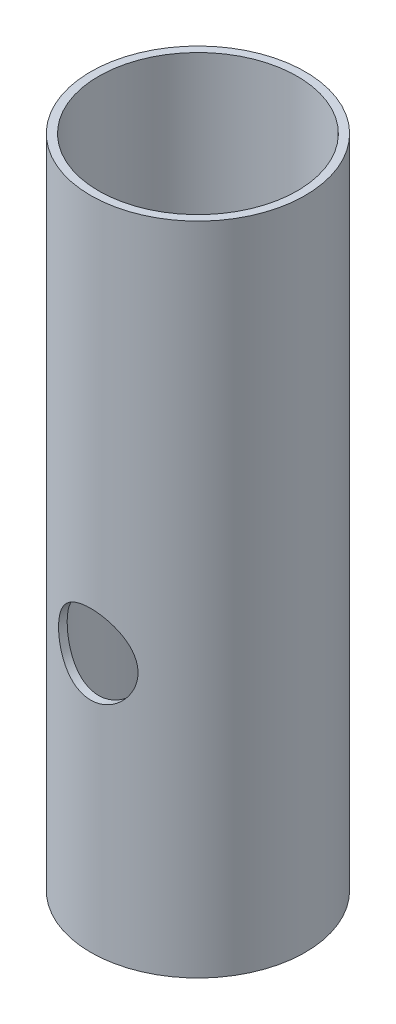
ISO-10303-21;
HEADER;
FILE_DESCRIPTION(('STEP AP214'),'2;1');
FILE_NAME('part.step','',(''),(''),'','','');
FILE_SCHEMA(('AUTOMOTIVE_DESIGN { 1 0 10303 214 1 1 1 1 }'));
ENDSEC;
DATA;
#1=APPLICATION_CONTEXT('core data for automotive mechanical design processes');
#2=APPLICATION_PROTOCOL_DEFINITION('international standard','automotive_design',2000,#1);
#3=PRODUCT_CONTEXT('',#1,'mechanical');
#4=PRODUCT('Part','Part','',(#3));
#5=PRODUCT_RELATED_PRODUCT_CATEGORY('part','',(#4));
#6=PRODUCT_DEFINITION_FORMATION('','',#4);
#7=PRODUCT_DEFINITION_CONTEXT('part definition',#1,'design');
#8=PRODUCT_DEFINITION('design','',#6,#7);
#9=PRODUCT_DEFINITION_SHAPE('','',#8);
#10=(LENGTH_UNIT() NAMED_UNIT(*) SI_UNIT(.MILLI.,.METRE.));
#11=(NAMED_UNIT(*) PLANE_ANGLE_UNIT() SI_UNIT($,.RADIAN.));
#12=(NAMED_UNIT(*) SI_UNIT($,.STERADIAN.) SOLID_ANGLE_UNIT());
#13=UNCERTAINTY_MEASURE_WITH_UNIT(LENGTH_MEASURE(1.E-05),#10,'distance_accuracy_value','');
#14=(GEOMETRIC_REPRESENTATION_CONTEXT(3) GLOBAL_UNCERTAINTY_ASSIGNED_CONTEXT((#13)) GLOBAL_UNIT_ASSIGNED_CONTEXT((#10,
#11,#12)) REPRESENTATION_CONTEXT('',''));
#15=CARTESIAN_POINT('',(0.,0.,0.));
#16=DIRECTION('',(0.,0.,1.));
#17=DIRECTION('',(1.,0.,0.));
#18=AXIS2_PLACEMENT_3D('',#15,#16,#17);
#19=CARTESIAN_POINT('',(0.,5.,0.));
#20=DIRECTION('',(0.,-1.,0.));
#21=DIRECTION('',(0.,0.,-1.));
#22=AXIS2_PLACEMENT_3D('',#19,#20,#21);
#23=CYLINDRICAL_SURFACE('',#22,27.);
#24=CARTESIAN_POINT('',(0.,25.,-27.));
#25=CARTESIAN_POINT('',(-0.139198402917015,25.0000024699379,-27.0000011760326));
#26=CARTESIAN_POINT('',(-0.278364741431728,24.9941854977806,-26.998921618947));
#27=CARTESIAN_POINT('',(-0.555737001810643,24.9709675004771,-26.9946360919045));
#28=CARTESIAN_POINT('',(-0.693942743802337,24.9535643618775,-26.9914297339944));
#29=CARTESIAN_POINT('',(-0.968433858074518,24.9072928039426,-26.9829762754062));
#30=CARTESIAN_POINT('',(-1.10471808993002,24.8784178500327,-26.9777280116532));
#31=CARTESIAN_POINT('',(-1.37437288093466,24.8094151357267,-26.9653355643094));
#32=CARTESIAN_POINT('',(-1.50774235059127,24.7692832426621,-26.9581906844812));
#33=CARTESIAN_POINT('',(-1.77041125219825,24.6781348695009,-26.9422147776107));
#34=CARTESIAN_POINT('',(-1.89971565930157,24.6271323403382,-26.9333859132381));
#35=CARTESIAN_POINT('',(-2.15358925706926,24.5145698675467,-26.9142762389755));
#36=CARTESIAN_POINT('',(-2.27815668135701,24.4530060319632,-26.9039948940782));
#37=CARTESIAN_POINT('',(-2.52160311539131,24.3198102716848,-26.882270136108));
#38=CARTESIAN_POINT('',(-2.6404847681323,24.2481830870598,-26.8708272708381));
#39=CARTESIAN_POINT('',(-2.87186925318301,24.0953145695971,-26.847083644871));
#40=CARTESIAN_POINT('',(-2.98436968540746,24.0140696543718,-26.8347825652134));
#41=CARTESIAN_POINT('',(-3.20329822260329,23.8416777842821,-26.8095346280705));
#42=CARTESIAN_POINT('',(-3.30965344061784,23.7504390271541,-26.7965824992416));
#43=CARTESIAN_POINT('',(-3.51436118055656,23.559336923782,-26.7705046387995));
#44=CARTESIAN_POINT('',(-3.61271072361219,23.4594703954246,-26.7573788446592));
#45=CARTESIAN_POINT('',(-3.80066580254504,23.2518520140036,-26.7313288283512));
#46=CARTESIAN_POINT('',(-3.89027391740952,23.1441025031771,-26.7184045476821));
#47=CARTESIAN_POINT('',(-4.06019218856549,22.9213808823963,-26.6931118949527));
#48=CARTESIAN_POINT('',(-4.14049890346408,22.806406123313,-26.6807437296764));
#49=CARTESIAN_POINT('',(-4.29176597473289,22.5691785019454,-26.6568312938301));
#50=CARTESIAN_POINT('',(-4.362653207532,22.4468783093466,-26.6452937555931));
#51=CARTESIAN_POINT('',(-4.49388512111766,22.1965825592915,-26.6234750384761));
#52=CARTESIAN_POINT('',(-4.55422585467415,22.0685848918374,-26.6131943304199));
#53=CARTESIAN_POINT('',(-4.66385450609767,21.8078818598037,-26.5942017209862));
#54=CARTESIAN_POINT('',(-4.71314723777014,21.6751785748495,-26.5854891366774));
#55=CARTESIAN_POINT('',(-4.80034627845553,21.4059642558315,-26.5698816277064));
#56=CARTESIAN_POINT('',(-4.83824844410836,21.2694518558735,-26.5629873645764));
#57=CARTESIAN_POINT('',(-4.93360282440063,20.85889044707,-26.5455068588294));
#58=CARTESIAN_POINT('',(-4.97407286177455,20.5805454751035,-26.5378770786056));
#59=CARTESIAN_POINT('',(-5.00781350821562,20.02107274101,-26.531529781667));
#60=CARTESIAN_POINT('',(-5.00108824490366,19.7399452243869,-26.5328114855687));
#61=CARTESIAN_POINT('',(-4.94112067014499,19.1865112218683,-26.5440430060161));
#62=CARTESIAN_POINT('',(-4.88847647356788,18.9141378315625,-26.5538813635239));
#63=CARTESIAN_POINT('',(-4.73909006529292,18.3821679286725,-26.5809467878035));
#64=CARTESIAN_POINT('',(-4.64234602147123,18.122571947421,-26.5981741615496));
#65=CARTESIAN_POINT('',(-4.40692302242312,17.6217574367947,-26.6381924444912));
#66=CARTESIAN_POINT('',(-4.26800169471492,17.3806554906389,-26.6610153586482));
#67=CARTESIAN_POINT('',(-3.95233788575468,16.9249598028895,-26.7096321661023));
#68=CARTESIAN_POINT('',(-3.77559165724601,16.7103686910096,-26.7354263536418));
#69=CARTESIAN_POINT('',(-3.38606586091672,16.3103276604886,-26.7875656015517));
#70=CARTESIAN_POINT('',(-3.17277436954698,16.1253761554364,-26.8139130365231));
#71=CARTESIAN_POINT('',(-2.71792765346526,15.7938052179575,-26.8638256425554));
#72=CARTESIAN_POINT('',(-2.47637215844227,15.6471861521775,-26.8873907870028));
#73=CARTESIAN_POINT('',(-1.97134041142274,15.3963718655069,-26.9291294720956));
#74=CARTESIAN_POINT('',(-1.70783829891926,15.2922275708276,-26.9472965335321));
#75=CARTESIAN_POINT('',(-1.16666908303804,15.1298181948348,-26.9761418521993));
#76=CARTESIAN_POINT('',(-0.889003450074572,15.0715483612524,-26.9868208851242));
#77=CARTESIAN_POINT('',(-0.331678067329911,15.003233601309,-26.9993806216607));
#78=CARTESIAN_POINT('',(-0.0521047604580329,14.9925056164801,-27.0013859349809));
#79=CARTESIAN_POINT('',(0.504841227279062,15.0177481559002,-26.9967161584468));
#80=CARTESIAN_POINT('',(0.782214012865334,15.0537164443351,-26.9900414841897));
#81=CARTESIAN_POINT('',(1.32472541033309,15.1707625698083,-26.9688392462935));
#82=CARTESIAN_POINT('',(1.58994095417485,15.2514956488091,-26.9543717236507));
#83=CARTESIAN_POINT('',(2.10307229237477,15.4554072806439,-26.9191992846172));
#84=CARTESIAN_POINT('',(2.35098693344422,15.5785886598636,-26.8984939528987));
#85=CARTESIAN_POINT('',(2.82540029765124,15.8654178872001,-26.8528318274112));
#86=CARTESIAN_POINT('',(3.05164178995463,16.0294841941351,-26.8278319567766));
#87=CARTESIAN_POINT('',(3.47362664401047,16.3928597126668,-26.7764670490438));
#88=CARTESIAN_POINT('',(3.66936722957032,16.5921721288437,-26.7501018879675));
#89=CARTESIAN_POINT('',(4.02738236994322,17.023467414594,-26.6985655708327));
#90=CARTESIAN_POINT('',(4.18919130474708,17.2558395191944,-26.6734142698489));
#91=CARTESIAN_POINT('',(4.4714776407916,17.7448791906698,-26.6275502006372));
#92=CARTESIAN_POINT('',(4.5919565544822,18.0015458680594,-26.60683727));
#93=CARTESIAN_POINT('',(4.78750295904115,18.5306391636166,-26.5723479341953));
#94=CARTESIAN_POINT('',(4.86278597635453,18.8029840856091,-26.5585386610783));
#95=CARTESIAN_POINT('',(4.96645343221114,19.3568929076955,-26.5393525646918));
#96=CARTESIAN_POINT('',(4.99484301747581,19.6384557926253,-26.5339748160358));
#97=CARTESIAN_POINT('',(5.00158852952929,20.0589089414851,-26.532696651101));
#98=CARTESIAN_POINT('',(4.99801841818649,20.1977290890438,-26.5333727366401));
#99=CARTESIAN_POINT('',(4.97935794118038,20.4745513666945,-26.5368822181021));
#100=CARTESIAN_POINT('',(4.9642719264776,20.6125537859016,-26.5397147992527));
#101=CARTESIAN_POINT('',(4.92268491008954,20.8868075856237,-26.5474595904347));
#102=CARTESIAN_POINT('',(4.89617987477714,21.0230583298504,-26.5523725353184));
#103=CARTESIAN_POINT('',(4.83197423775583,21.2927606543773,-26.5641316565512));
#104=CARTESIAN_POINT('',(4.79427764615038,21.4262132190011,-26.5709771403993));
#105=CARTESIAN_POINT('',(4.7080331044283,21.689246688444,-26.5863938481191));
#106=CARTESIAN_POINT('',(4.65950083237687,21.8188328834335,-26.5949625768803));
#107=CARTESIAN_POINT('',(4.55193218479288,22.0734032055797,-26.6135846855079));
#108=CARTESIAN_POINT('',(4.49289954674211,22.1983889511701,-26.6236375369025));
#109=CARTESIAN_POINT('',(4.36471650732065,22.4430157760895,-26.6449520627182));
#110=CARTESIAN_POINT('',(4.29556201217364,22.56265466721,-26.6562142257511));
#111=CARTESIAN_POINT('',(4.14766332945921,22.7956982357219,-26.6796268741514));
#112=CARTESIAN_POINT('',(4.06892247017642,22.9091050570872,-26.6917770506276));
#113=CARTESIAN_POINT('',(3.90112008646803,23.1306321808723,-26.7168217248427));
#114=CARTESIAN_POINT('',(3.81192159643535,23.2386478083144,-26.7297246475154));
#115=CARTESIAN_POINT('',(3.62482765689544,23.4467662061842,-26.7557384293541));
#116=CARTESIAN_POINT('',(3.52693529764822,23.5468717645477,-26.768849213285));
#117=CARTESIAN_POINT('',(3.32303121539505,23.7385903880359,-26.7949254742098));
#118=CARTESIAN_POINT('',(3.21701470567308,23.83019837507,-26.8078908602986));
#119=CARTESIAN_POINT('',(2.99767204355295,24.0041917487035,-26.8333029054358));
#120=CARTESIAN_POINT('',(2.88434860000572,24.0865805224465,-26.8457497539332));
#121=CARTESIAN_POINT('',(2.65005582718615,24.2423071138785,-26.8698938586938));
#122=CARTESIAN_POINT('',(2.52902603241717,24.3155552300992,-26.8815832152708));
#123=CARTESIAN_POINT('',(2.28115676236411,24.4515504201487,-26.9037506731026));
#124=CARTESIAN_POINT('',(2.15431944836312,24.5143013607151,-26.9142292199292));
#125=CARTESIAN_POINT('',(1.8957642577606,24.6288284091112,-26.9336753084542));
#126=CARTESIAN_POINT('',(1.76404960331676,24.6806116158723,-26.9426438267518));
#127=CARTESIAN_POINT('',(1.49665137338272,24.7728443203058,-26.9588202455209));
#128=CARTESIAN_POINT('',(1.36096860954095,24.8132961180767,-26.9660285032595));
#129=CARTESIAN_POINT('',(1.02412394362162,24.8983181757332,-26.9813086011654));
#130=CARTESIAN_POINT('',(0.82123704178827,24.9364000497733,-26.9882832155661));
#131=CARTESIAN_POINT('',(0.412209949645323,24.9872388251297,-26.9976279883876));
#132=CARTESIAN_POINT('',(0.206069838726203,24.9999963434947,-26.999998258997));
#133=CARTESIAN_POINT('',(0.,25.,-27.));
#134=B_SPLINE_CURVE_WITH_KNOTS('',3,(#24,#25,#26,#27,#28,#29,#30,#31,#32,#33,#34,#35,#36,#37,
#38,#39,#40,#41,#42,#43,#44,#45,#46,#47,#48,#49,#50,#51,#52,#53,#54,#55,#56,#57,#58,#59,#60,#61,
#62,#63,#64,#65,#66,#67,#68,#69,#70,#71,#72,#73,#74,#75,#76,#77,#78,#79,#80,#81,#82,#83,#84,#85,
#86,#87,#88,#89,#90,#91,#92,#93,#94,#95,#96,#97,#98,#99,#100,#101,#102,#103,#104,#105,#106,#107,
#108,#109,#110,#111,#112,#113,#114,#115,#116,#117,#118,#119,#120,#121,#122,#123,#124,#125,#126,
#127,#128,#129,#130,#131,#132,#133),.UNSPECIFIED.,.T.,.F.,(4,2,2,2,2,2,2,2,2,2,2,2,2,2,2,2,2,2,
2,2,2,2,2,2,2,2,2,2,2,2,2,2,2,2,2,2,2,2,2,2,2,2,2,2,2,2,2,2,2,2,2,2,2,2,4),(0.,
0.417414414219026,0.834904990619155,1.25263371971893,1.67051600733864,2.08786519661789,
2.50536851522833,2.9226758353476,3.34013908502159,3.761822729252,4.183662569195,
4.60537757474685,5.02724811410075,5.4522229871075,5.87735657611475,6.30230456539235,
6.72740694447776,7.56708366936304,8.40668695846264,9.23551464686312,10.0643767719678,
10.8980951363515,11.7318961342398,12.5785084329708,13.4251288291868,14.2727613393803,
15.1203060292981,15.9556332815038,16.7909205397769,17.6198623968535,18.4488594590207,
19.2867173812501,20.1246515208187,20.9734240496102,21.8221655147125,22.6668267406601,
23.5113952558636,23.9275921239081,24.3436318214425,24.7598186004797,25.1758564331286,
25.5912961604926,26.0065883117973,26.4220488941772,26.8373656421788,27.2589054795571,
27.6802960745885,28.1019368889602,28.5234222801015,28.9487637606396,29.3739482158003,
29.7988566210276,30.2236787138998,30.841635638387,31.4595775056611),.UNSPECIFIED.);
#135=CARTESIAN_POINT('',(0.,25.,-27.));
#136=VERTEX_POINT('',#135);
#137=EDGE_CURVE('E58',#136,#136,#134,.T.);
#138=ORIENTED_EDGE('',*,*,#137,.T.);
#139=EDGE_LOOP('',(#138));
#140=FACE_BOUND('',#139,.T.);
#141=CARTESIAN_POINT('',(0.,0.,0.));
#142=DIRECTION('',(0.,1.,0.));
#143=DIRECTION('',(0.,0.,1.));
#144=AXIS2_PLACEMENT_3D('',#141,#142,#143);
#145=CIRCLE('',#144,27.);
#146=CARTESIAN_POINT('',(0.,0.,27.));
#147=VERTEX_POINT('',#146);
#148=EDGE_CURVE('E44',#147,#147,#145,.T.);
#149=ORIENTED_EDGE('',*,*,#148,.T.);
#150=EDGE_LOOP('',(#149));
#151=FACE_BOUND('',#150,.T.);
#152=CARTESIAN_POINT('',(0.,165.,0.));
#153=DIRECTION('',(0.,1.,0.));
#154=DIRECTION('',(0.,0.,1.));
#155=AXIS2_PLACEMENT_3D('',#152,#153,#154);
#156=CIRCLE('',#155,27.);
#157=CARTESIAN_POINT('',(0.,165.,27.));
#158=VERTEX_POINT('',#157);
#159=EDGE_CURVE('E49',#158,#158,#156,.T.);
#160=ORIENTED_EDGE('',*,*,#159,.F.);
#161=EDGE_LOOP('',(#160));
#162=FACE_BOUND('',#161,.T.);
#163=CARTESIAN_POINT('',(-10.,65.,25.0798724079689));
#164=CARTESIAN_POINT('',(-10.0000011550061,64.7297140573613,25.0798713723629));
#165=CARTESIAN_POINT('',(-9.98903297921322,64.4594439172395,25.0842534331659));
#166=CARTESIAN_POINT('',(-9.94528269488038,63.92097014579,25.1016316203884));
#167=CARTESIAN_POINT('',(-9.91250221717031,63.6527663614846,25.1146271028123));
#168=CARTESIAN_POINT('',(-9.82547189344176,63.120411981147,25.1488027245415));
#169=CARTESIAN_POINT('',(-9.77122264708189,62.8562612721198,25.1699826352417));
#170=CARTESIAN_POINT('',(-9.64179137329027,62.3338648579045,25.2198465632144));
#171=CARTESIAN_POINT('',(-9.56660878066733,62.0756193123571,25.2485307830986));
#172=CARTESIAN_POINT('',(-9.3962247273947,61.5674202658445,25.312431880349));
#173=CARTESIAN_POINT('',(-9.30107579819141,61.3174469601034,25.3476315873616));
#174=CARTESIAN_POINT('',(-9.09139709463204,60.8265399989259,25.423589994267));
#175=CARTESIAN_POINT('',(-8.9768601032582,60.5856097506312,25.4643507631109));
#176=CARTESIAN_POINT('',(-8.72929081710232,60.114270917515,25.5502767437797));
#177=CARTESIAN_POINT('',(-8.59625815610162,59.8838625411491,25.5954420428099));
#178=CARTESIAN_POINT('',(-8.31259676404462,59.4348161318569,25.6889671406282));
#179=CARTESIAN_POINT('',(-8.16196680930816,59.2161789190197,25.7373271614691));
#180=CARTESIAN_POINT('',(-7.83703851370467,58.7824892863609,25.8381697501776));
#181=CARTESIAN_POINT('',(-7.66198981837303,58.5680191193048,25.8907400777412));
#182=CARTESIAN_POINT('',(-7.29481966855151,58.1544114505605,25.9965787002857));
#183=CARTESIAN_POINT('',(-7.10269781863598,57.9552743041948,26.0498470114081));
#184=CARTESIAN_POINT('',(-6.70246907261707,57.5734656571131,26.1556830319745));
#185=CARTESIAN_POINT('',(-6.49435866980428,57.3907977877465,26.20825058474));
#186=CARTESIAN_POINT('',(-6.06339717462268,57.0431247310178,26.311295949434));
#187=CARTESIAN_POINT('',(-5.840546536294,56.8781190000225,26.3617738256526));
#188=CARTESIAN_POINT('',(-5.37371136082189,56.5616725125445,26.4609531035518));
#189=CARTESIAN_POINT('',(-5.12926951733713,56.4108690471488,26.5095388290716));
#190=CARTESIAN_POINT('',(-4.62768647214009,56.1305568462622,26.6016823001789));
#191=CARTESIAN_POINT('',(-4.37055041272827,56.0010395785095,26.6452420582556));
#192=CARTESIAN_POINT('',(-3.84524478679292,55.7643584447441,26.7261052109893));
#193=CARTESIAN_POINT('',(-3.57707573408796,55.657193539165,26.7634088965886));
#194=CARTESIAN_POINT('',(-3.0316465071746,55.466239232147,26.830665312604));
#195=CARTESIAN_POINT('',(-2.75438682367014,55.3824485713016,26.8606184390584));
#196=CARTESIAN_POINT('',(-2.20476280808341,55.2421292697875,26.9111862139217));
#197=CARTESIAN_POINT('',(-1.93268509656797,55.1845999908472,26.9321414015762));
#198=CARTESIAN_POINT('',(-1.3841869941343,55.0923586733355,26.9658952930446));
#199=CARTESIAN_POINT('',(-1.10776671483025,55.0576460493017,26.9786942061437));
#200=CARTESIAN_POINT('',(-0.552806137174213,55.0114107264178,26.9957673272696));
#201=CARTESIAN_POINT('',(-0.274266434516458,54.999881736782,27.0000438478106));
#202=CARTESIAN_POINT('',(0.282797675549965,55.000120082761,26.999955478286));
#203=CARTESIAN_POINT('',(0.561322083167571,55.0118867338105,26.9955908421494));
#204=CARTESIAN_POINT('',(1.10272483121894,55.0574552748581,26.9787653449907));
#205=CARTESIAN_POINT('',(1.36570853853434,55.090164238096,26.966706145555));
#206=CARTESIAN_POINT('',(1.88781062297819,55.1762447793707,26.9351919014149));
#207=CARTESIAN_POINT('',(2.14692914737032,55.2296155680918,26.9157371392337));
#208=CARTESIAN_POINT('',(2.65951065518817,55.356519890604,26.8699313650475));
#209=CARTESIAN_POINT('',(2.91297443473487,55.4300505665023,26.8435813305497));
#210=CARTESIAN_POINT('',(3.41274157328927,55.5966704074894,26.7846324845837));
#211=CARTESIAN_POINT('',(3.65904216779192,55.6897670126061,26.7520312965022));
#212=CARTESIAN_POINT('',(4.14627323889639,55.896187668062,26.6808898597013));
#213=CARTESIAN_POINT('',(4.38708001399858,56.0097770073645,26.6422727536576));
#214=CARTESIAN_POINT('',(4.85834361621836,56.2554508793277,26.5603788899745));
#215=CARTESIAN_POINT('',(5.08879660009579,56.3875422060695,26.5171004219998));
#216=CARTESIAN_POINT('',(5.53798757127591,56.6692745576577,26.4269403965103));
#217=CARTESIAN_POINT('',(5.75672472166832,56.8189168338118,26.3800585821745));
#218=CARTESIAN_POINT('',(6.18130005273825,57.1347887501456,26.2838148462872));
#219=CARTESIAN_POINT('',(6.3871376497702,57.3010191399803,26.2344528126988));
#220=CARTESIAN_POINT('',(6.79626310838086,57.6590947358646,26.1315484035283));
#221=CARTESIAN_POINT('',(6.99872448888748,57.8518630261315,26.0779288227679));
#222=CARTESIAN_POINT('',(7.38672518699647,58.2535755330767,25.9706911168711));
#223=CARTESIAN_POINT('',(7.57227130477012,58.462513186431,25.9170729998899));
#224=CARTESIAN_POINT('',(7.92551384729213,58.8955464794496,25.8112427993264));
#225=CARTESIAN_POINT('',(8.09319842009201,59.1196520244159,25.7590316662927));
#226=CARTESIAN_POINT('',(8.4094050583967,59.581495005281,25.6575423000062));
#227=CARTESIAN_POINT('',(8.55793470689548,59.8192269926141,25.6082629103314));
#228=CARTESIAN_POINT('',(8.83784199332797,60.3122883349769,25.5130336653622));
#229=CARTESIAN_POINT('',(8.96877738294191,60.5678876407551,25.4671792912929));
#230=CARTESIAN_POINT('',(9.208447624076,61.0901407059952,25.3815030028422));
#231=CARTESIAN_POINT('',(9.31719190738696,61.3567897108324,25.3416785274637));
#232=CARTESIAN_POINT('',(9.5115064209529,61.8993153265689,25.269388634327));
#233=CARTESIAN_POINT('',(9.59708174652931,62.1751898935625,25.2369215987758));
#234=CARTESIAN_POINT('',(9.74419322078022,62.7341242350646,25.1804869288936));
#235=CARTESIAN_POINT('',(9.8057309708933,63.0171835295715,25.1565187283605));
#236=CARTESIAN_POINT('',(9.90141705470114,63.5727488431133,25.1190053900052));
#237=CARTESIAN_POINT('',(9.93686641386935,63.8449979458521,25.1049667538003));
#238=CARTESIAN_POINT('',(9.98525986601959,64.3917991478364,25.0857583305558));
#239=CARTESIAN_POINT('',(9.99820477204834,64.6663511635214,25.0805882231116));
#240=CARTESIAN_POINT('',(10.0014465413086,65.215549953526,25.0792956218961));
#241=CARTESIAN_POINT('',(9.99174821930092,65.490196695287,25.0831712046872));
#242=CARTESIAN_POINT('',(9.9498209560687,66.0374874422488,25.0998320816383));
#243=CARTESIAN_POINT('',(9.9175924311804,66.3101314843635,25.1126172111585));
#244=CARTESIAN_POINT('',(9.83295660451179,66.8388320731066,25.1458728073949));
#245=CARTESIAN_POINT('',(9.78154872321663,67.0950736236566,25.1659615461281));
#246=CARTESIAN_POINT('',(9.65901314672917,67.6022185951883,25.2132460120749));
#247=CARTESIAN_POINT('',(9.58787854253444,67.8531201126886,25.2404442290896));
#248=CARTESIAN_POINT('',(9.42653423931621,68.3478561461486,25.3011436621293));
#249=CARTESIAN_POINT('',(9.33632879521646,68.5916922247136,25.3346434720129));
#250=CARTESIAN_POINT('',(9.13751464972073,69.0710167209672,25.407026862865));
#251=CARTESIAN_POINT('',(9.02889879851405,69.3065018523792,25.4459125343937));
#252=CARTESIAN_POINT('',(8.78978835817814,69.7761451715162,25.5295169203818));
#253=CARTESIAN_POINT('',(8.65864059887493,70.0099421293634,25.574396585112));
#254=CARTESIAN_POINT('',(8.37830149592969,70.4658682964472,25.667603805755));
#255=CARTESIAN_POINT('',(8.22910212580803,70.6879922519643,25.715932891475));
#256=CARTESIAN_POINT('',(7.91363896094478,71.1192898318428,25.8147561220227));
#257=CARTESIAN_POINT('',(7.74737359487617,71.3284622608632,25.8652504659639));
#258=CARTESIAN_POINT('',(7.39876323145392,71.7327221891947,25.9671191426281));
#259=CARTESIAN_POINT('',(7.21641772839322,71.9278092451812,26.0184935029859));
#260=CARTESIAN_POINT('',(6.82490208429725,72.3144381011406,26.12401779295));
#261=CARTESIAN_POINT('',(6.6147704117246,72.5050144904492,26.1781428827743));
#262=CARTESIAN_POINT('',(6.17886524442573,72.8677824803851,26.2844427064865));
#263=CARTESIAN_POINT('',(5.95309728716517,73.0399805352113,26.3366181208605));
#264=CARTESIAN_POINT('',(5.48711837822675,73.3649414561417,26.4376319025585));
#265=CARTESIAN_POINT('',(5.24690124327256,73.5176959133007,26.4864688218556));
#266=CARTESIAN_POINT('',(4.75372421452851,73.8024510396401,26.5794099560901));
#267=CARTESIAN_POINT('',(4.50076983085757,73.9344605829128,26.6235161921035));
#268=CARTESIAN_POINT('',(3.98464582300339,74.1762468112113,26.7056289555748));
#269=CARTESIAN_POINT('',(3.7215171665694,74.2861034374918,26.7436573087696));
#270=CARTESIAN_POINT('',(3.18601260561138,74.4831808441853,26.8127244999984));
#271=CARTESIAN_POINT('',(2.91363665868317,74.5704015207833,26.8437633059762));
#272=CARTESIAN_POINT('',(2.36177600082438,74.72130709449,26.8979339262237));
#273=CARTESIAN_POINT('',(2.08229401276862,74.785000865534,26.9210687214998));
#274=CARTESIAN_POINT('',(1.51833487721256,74.8882162480449,26.9587556249014));
#275=CARTESIAN_POINT('',(1.23385800917682,74.9277392074684,26.9733082116376));
#276=CARTESIAN_POINT('',(0.678562203032188,74.9806237563505,26.9928192452164));
#277=CARTESIAN_POINT('',(0.407889852599925,74.9953490840449,26.9982776248685));
#278=CARTESIAN_POINT('',(-0.133792487024903,75.002772593622,27.0010267283826));
#279=CARTESIAN_POINT('',(-0.40480246213891,74.9954716651427,26.998317782122));
#280=CARTESIAN_POINT('',(-0.9451009278166,74.9589203536208,26.9848069963055));
#281=CARTESIAN_POINT('',(-1.2143896043005,74.9296723829421,26.9740060462026));
#282=CARTESIAN_POINT('',(-1.74929018927361,74.8495238110687,26.9446048602483));
#283=CARTESIAN_POINT('',(-2.01490209862694,74.7986232149629,26.9260046262301));
#284=CARTESIAN_POINT('',(-2.53434628753126,74.6771150071857,26.8820280188262));
#285=CARTESIAN_POINT('',(-2.78830864516077,74.6070004185345,26.8568217792371));
#286=CARTESIAN_POINT('',(-3.28935976404342,74.447184075107,26.8000691735547));
#287=CARTESIAN_POINT('',(-3.53644605052938,74.3574753684251,26.7685205575315));
#288=CARTESIAN_POINT('',(-4.02207592340399,74.1592399335787,26.6998695958605));
#289=CARTESIAN_POINT('',(-4.26062146708816,74.0507175507123,26.6627685329029));
#290=CARTESIAN_POINT('',(-4.72793973410548,73.81561300558,26.5838817612611));
#291=CARTESIAN_POINT('',(-4.9567086383057,73.6890238680413,26.5420942445562));
#292=CARTESIAN_POINT('',(-5.41231706996728,73.4131228099048,26.4530318845872));
#293=CARTESIAN_POINT('',(-5.63869005110448,73.2630903376493,26.4056020199905));
#294=CARTESIAN_POINT('',(-6.07819687203212,72.9453815474663,26.3079120048908));
#295=CARTESIAN_POINT('',(-6.29132467739441,72.7776972798496,26.2576505839413));
#296=CARTESIAN_POINT('',(-6.70307710725236,72.4257734509035,26.1555683809954));
#297=CARTESIAN_POINT('',(-6.90170031466042,72.2415322758894,26.1037474473324));
#298=CARTESIAN_POINT('',(-7.28332210564724,71.857586098519,25.9998526100466));
#299=CARTESIAN_POINT('',(-7.46632035173727,71.6578807623249,25.9477787009854));
#300=CARTESIAN_POINT('',(-7.82463864147208,71.2334638741708,25.8420529398366));
#301=CARTESIAN_POINT('',(-7.99907896158761,71.0079943483937,25.7884577853355));
#302=CARTESIAN_POINT('',(-8.32828275689688,70.5426445657129,25.6840325304993));
#303=CARTESIAN_POINT('',(-8.48305350789415,70.3027696860037,25.6332014117473));
#304=CARTESIAN_POINT('',(-8.771928017352,69.8098764849173,25.5357893210735));
#305=CARTESIAN_POINT('',(-8.90602109154596,69.5568514584641,25.4892105514004));
#306=CARTESIAN_POINT('',(-9.15228479593728,69.0395191996151,25.4018258742664));
#307=CARTESIAN_POINT('',(-9.26446486735998,68.7752168861139,25.3610174827379));
#308=CARTESIAN_POINT('',(-9.46933901824939,68.227974150616,25.285251939418));
#309=CARTESIAN_POINT('',(-9.56124979930298,67.9447058138874,25.2505380716153));
#310=CARTESIAN_POINT('',(-9.7196184185433,67.370190306056,25.1900023772557));
#311=CARTESIAN_POINT('',(-9.78607535988576,67.0789428542031,25.1641808640164));
#312=CARTESIAN_POINT('',(-9.89271048037573,66.4911254757082,25.1224514336753));
#313=CARTESIAN_POINT('',(-9.93290237153013,66.1945584094635,25.1065383439587));
#314=CARTESIAN_POINT('',(-9.98654512038533,65.5986542441078,25.0852499449596));
#315=CARTESIAN_POINT('',(-9.99999872093433,65.2993174322861,25.0798735548096));
#316=CARTESIAN_POINT('',(-10.,65.,25.0798724079689));
#317=B_SPLINE_CURVE_WITH_KNOTS('',3,(#163,#164,#165,#166,#167,#168,#169,#170,#171,#172,#173,
#174,#175,#176,#177,#178,#179,#180,#181,#182,#183,#184,#185,#186,#187,#188,#189,#190,#191,#192,
#193,#194,#195,#196,#197,#198,#199,#200,#201,#202,#203,#204,#205,#206,#207,#208,#209,#210,#211,
#212,#213,#214,#215,#216,#217,#218,#219,#220,#221,#222,#223,#224,#225,#226,#227,#228,#229,#230,
#231,#232,#233,#234,#235,#236,#237,#238,#239,#240,#241,#242,#243,#244,#245,#246,#247,#248,#249,
#250,#251,#252,#253,#254,#255,#256,#257,#258,#259,#260,#261,#262,#263,#264,#265,#266,#267,#268,
#269,#270,#271,#272,#273,#274,#275,#276,#277,#278,#279,#280,#281,#282,#283,#284,#285,#286,#287,
#288,#289,#290,#291,#292,#293,#294,#295,#296,#297,#298,#299,#300,#301,#302,#303,#304,#305,#306,
#307,#308,#309,#310,#311,#312,#313,#314,#315,#316),.UNSPECIFIED.,.T.,.F.,(4,2,2,2,2,2,2,2,2,2,2,
2,2,2,2,2,2,2,2,2,2,2,2,2,2,2,2,2,2,2,2,2,2,2,2,2,2,2,2,2,2,2,2,2,2,2,2,2,2,2,2,2,2,2,2,2,2,2,2,
2,2,2,2,2,2,2,2,2,2,2,2,2,2,2,2,2,4),(0.,0.810574148130107,1.62108769926267,2.43157861299443,
3.24209141174885,4.05049790357772,4.85920598128627,5.66793007388806,6.47671043703732,
7.32112105979712,8.1655512447699,9.01016716709968,9.85475708502282,10.7275613605139,
11.6000149273528,12.472427908965,13.3447938758003,14.1803719728928,15.0159286286884,
15.8512585289429,16.6865638825744,17.4814816531102,18.2763690594768,19.0711438397482,
19.8662213850899,20.6724458854469,21.4789672179698,22.2855460870076,23.0921614237261,
23.9451362422188,24.7977666267062,25.650959291456,26.5038131532087,27.3751778672323,
28.2461714539234,29.1169733356657,29.9877171926845,30.8113803772687,31.6350138037176,
32.4584721121686,33.2819152043128,34.0673731529044,34.8531065450937,35.6386648157807,
36.4245288654672,37.2390375172442,38.0539096728943,38.8688569241428,39.6838298139571,
40.5492042471551,41.4142737666765,42.2797161484421,43.1447873045118,44.0066785766045,
44.8685738015018,45.7301436018983,46.5916653499325,47.4040425521831,48.2163869430442,
49.0286420561194,49.8408969782941,50.6339978261779,51.427380521107,52.2205802160485,
53.0140869847968,53.8402378758633,54.666762438309,55.493367643808,56.3199906989141,
57.1891517699885,58.0579903954584,58.9272764609888,59.7961871641778,60.6943550549459,
61.5925545889807,62.4902848310033,63.3879229779497),.UNSPECIFIED.);
#318=CARTESIAN_POINT('',(-10.,65.,25.0798724079689));
#319=VERTEX_POINT('',#318);
#320=EDGE_CURVE('E59',#319,#319,#317,.T.);
#321=ORIENTED_EDGE('',*,*,#320,.F.);
#322=EDGE_LOOP('',(#321));
#323=FACE_BOUND('',#322,.T.);
#324=ADVANCED_FACE('F31',(#140,#151,#162,#323),#23,.T.);
#325=CARTESIAN_POINT('',(0.,165.,0.));
#326=DIRECTION('',(0.,-1.,0.));
#327=DIRECTION('',(0.,0.,-1.));
#328=AXIS2_PLACEMENT_3D('',#325,#326,#327);
#329=CYLINDRICAL_SURFACE('',#328,25.);
#330=CARTESIAN_POINT('',(0.,5.,0.));
#331=DIRECTION('',(0.,1.,0.));
#332=DIRECTION('',(0.,0.,1.));
#333=AXIS2_PLACEMENT_3D('',#330,#331,#332);
#334=CIRCLE('',#333,25.);
#335=CARTESIAN_POINT('',(0.,5.,25.));
#336=VERTEX_POINT('',#335);
#337=EDGE_CURVE('E10',#336,#336,#334,.F.);
#338=ORIENTED_EDGE('',*,*,#337,.T.);
#339=EDGE_LOOP('',(#338));
#340=FACE_BOUND('',#339,.T.);
#341=CARTESIAN_POINT('',(0.,165.,0.));
#342=DIRECTION('',(0.,1.,0.));
#343=DIRECTION('',(0.,0.,1.));
#344=AXIS2_PLACEMENT_3D('',#341,#342,#343);
#345=CIRCLE('',#344,25.);
#346=CARTESIAN_POINT('',(0.,165.,25.));
#347=VERTEX_POINT('',#346);
#348=EDGE_CURVE('E78',#347,#347,#345,.T.);
#349=ORIENTED_EDGE('',*,*,#348,.T.);
#350=EDGE_LOOP('',(#349));
#351=FACE_BOUND('',#350,.T.);
#352=CARTESIAN_POINT('',(0.,25.,-25.));
#353=CARTESIAN_POINT('',(-0.138987493787324,25.0000027694463,-25.0000014065203));
#354=CARTESIAN_POINT('',(-0.277940302046088,24.9942032492811,-24.9988389427216));
#355=CARTESIAN_POINT('',(-0.554886864496205,24.9710563512974,-24.994224565157));
#356=CARTESIAN_POINT('',(-0.69288043279192,24.9537067948975,-24.9907722194715));
#357=CARTESIAN_POINT('',(-0.966937148503881,24.9075814377122,-24.981670242636));
#358=CARTESIAN_POINT('',(-1.10299928122357,24.8787998455141,-24.9760194978176));
#359=CARTESIAN_POINT('',(-1.37221108352448,24.810025349109,-24.9626762565998));
#360=CARTESIAN_POINT('',(-1.50535966309261,24.7700283237777,-24.9549830097359));
#361=CARTESIAN_POINT('',(-1.76758319373794,24.6791962522582,-24.9377804442932));
#362=CARTESIAN_POINT('',(-1.896663374225,24.6283758297848,-24.9282735779222));
#363=CARTESIAN_POINT('',(-2.15009997814348,24.5162240178123,-24.9076944208426));
#364=CARTESIAN_POINT('',(-2.2744546389337,24.4548887523412,-24.8966215531404));
#365=CARTESIAN_POINT('',(-2.51749782000809,24.3221945692906,-24.8732206370355));
#366=CARTESIAN_POINT('',(-2.63618884664851,24.2508401417061,-24.8608931515555));
#367=CARTESIAN_POINT('',(-2.86722020463685,24.0985603647523,-24.8353088041128));
#368=CARTESIAN_POINT('',(-2.97955814193968,24.0176314424647,-24.8220515959613));
#369=CARTESIAN_POINT('',(-3.1983785388143,23.8457711931702,-24.7948114657324));
#370=CARTESIAN_POINT('',(-3.30477652475172,23.7547333566458,-24.780821838943));
#371=CARTESIAN_POINT('',(-3.50958996762925,23.5640376679645,-24.7526457290753));
#372=CARTESIAN_POINT('',(-3.60800245195942,23.4643766340819,-24.738459174971));
#373=CARTESIAN_POINT('',(-3.79610927604841,23.2571655640739,-24.7102933832022));
#374=CARTESIAN_POINT('',(-3.88580612172819,23.1496178112366,-24.6963140869323));
#375=CARTESIAN_POINT('',(-4.05592901668139,22.9272928345424,-24.6689453876667));
#376=CARTESIAN_POINT('',(-4.13635163435981,22.8125129588355,-24.6555562041458));
#377=CARTESIAN_POINT('',(-4.28798741229219,22.5754841568505,-24.6296394657581));
#378=CARTESIAN_POINT('',(-4.35911381454495,22.4531786550123,-24.6171204770982));
#379=CARTESIAN_POINT('',(-4.49081269831453,22.2028712528765,-24.5934353082732));
#380=CARTESIAN_POINT('',(-4.55138122040544,22.0748672380124,-24.5822696361062));
#381=CARTESIAN_POINT('',(-4.71644727257975,21.6837416438572,-24.5513304070068));
#382=CARTESIAN_POINT('',(-4.8044888260482,21.4132193246056,-24.5340820165952));
#383=CARTESIAN_POINT('',(-4.93264780265691,20.8645385652061,-24.508635793463));
#384=CARTESIAN_POINT('',(-4.97337819482265,20.5865266702931,-24.5003223072134));
#385=CARTESIAN_POINT('',(-5.00775493418216,20.027461501124,-24.4933199482487));
#386=CARTESIAN_POINT('',(-5.00140609582258,19.7464085407904,-24.4946300913956));
#387=CARTESIAN_POINT('',(-4.94227436036826,19.1937632800715,-24.5066272442008));
#388=CARTESIAN_POINT('',(-4.89019310186595,18.9220922268258,-24.5171725589932));
#389=CARTESIAN_POINT('',(-4.7421890224497,18.3914203617583,-24.546227391949));
#390=CARTESIAN_POINT('',(-4.64626410780486,18.1324201556801,-24.5647372904543));
#391=CARTESIAN_POINT('',(-4.41262402680007,17.6324234898532,-24.6077809023025));
#392=CARTESIAN_POINT('',(-4.27463078523214,17.3915605480925,-24.632354484594));
#393=CARTESIAN_POINT('',(-3.96096784378849,16.9361458042038,-24.684730944745));
#394=CARTESIAN_POINT('',(-3.78529381392922,16.721597030353,-24.7125341935642));
#395=CARTESIAN_POINT('',(-3.39749968079915,16.3208529728437,-24.7688510603976));
#396=CARTESIAN_POINT('',(-3.18478080820447,16.1352371567135,-24.797368460096));
#397=CARTESIAN_POINT('',(-2.73092511816779,15.8022307724848,-24.8514424361697));
#398=CARTESIAN_POINT('',(-2.48978793632426,15.654840694624,-24.8769989745701));
#399=CARTESIAN_POINT('',(-1.98529693496818,15.4023624527765,-24.9223345079227));
#400=CARTESIAN_POINT('',(-1.72190909807365,15.2973405314029,-24.9421044423773));
#401=CARTESIAN_POINT('',(-1.1807448820962,15.1331976301815,-24.9735704494292));
#402=CARTESIAN_POINT('',(-0.902970250347201,15.0740710900358,-24.98526750005));
#403=CARTESIAN_POINT('',(-0.345897028150551,15.0042177306314,-24.9991335933204));
#404=CARTESIAN_POINT('',(-0.0667016415443252,14.9926979010851,-25.0014587325673));
#405=CARTESIAN_POINT('',(0.489624670880015,15.0162492959244,-24.9967525965614));
#406=CARTESIAN_POINT('',(0.766755711869965,15.0513179012196,-24.9897218472742));
#407=CARTESIAN_POINT('',(1.30852830007856,15.1663918633032,-24.9671916002008));
#408=CARTESIAN_POINT('',(1.57325974299468,15.2459903260944,-24.9517688194687));
#409=CARTESIAN_POINT('',(2.08561813620307,15.4474199296754,-24.9141776037933));
#410=CARTESIAN_POINT('',(2.33324380335236,15.5692542345549,-24.892008663478));
#411=CARTESIAN_POINT('',(2.80770587332562,15.853412391337,-24.8429955738642));
#412=CARTESIAN_POINT('',(3.03425065213174,16.0162136728006,-24.8160975113418));
#413=CARTESIAN_POINT('',(3.45709007722326,16.3770461884555,-24.760736752006));
#414=CARTESIAN_POINT('',(3.65338147605435,16.5750811997927,-24.7322738876682));
#415=CARTESIAN_POINT('',(4.01320302351496,17.0043658784477,-24.6764651380018));
#416=CARTESIAN_POINT('',(4.17618877400405,17.2360754097949,-24.6491428619003));
#417=CARTESIAN_POINT('',(4.46092683850574,17.7240601179627,-24.5992097395686));
#418=CARTESIAN_POINT('',(4.58268080227279,17.9803343113826,-24.5765987048474));
#419=CARTESIAN_POINT('',(4.78076018011429,18.5088289322538,-24.5388364729789));
#420=CARTESIAN_POINT('',(4.85732111853824,18.7809584178571,-24.5236466726876));
#421=CARTESIAN_POINT('',(4.96353963899985,19.3347130495845,-24.5023739077135));
#422=CARTESIAN_POINT('',(4.9932033375265,19.6163369525221,-24.4962897554484));
#423=CARTESIAN_POINT('',(5.00179339144585,20.0366703889551,-24.4945288792509));
#424=CARTESIAN_POINT('',(4.99885021968412,20.1752265681492,-24.4951330184965));
#425=CARTESIAN_POINT('',(4.98148651470878,20.4515737957145,-24.4986714739674));
#426=CARTESIAN_POINT('',(4.9670703371849,20.5893651144752,-24.5016049058833));
#427=CARTESIAN_POINT('',(4.92686276339316,20.8632490159191,-24.5097212135577));
#428=CARTESIAN_POINT('',(4.90106738632089,20.9993409869687,-24.5149048765081));
#429=CARTESIAN_POINT('',(4.83831799577184,21.2687799057397,-24.5273664043086));
#430=CARTESIAN_POINT('',(4.80136796328246,21.402127814684,-24.5346435219816));
#431=CARTESIAN_POINT('',(4.71667811844351,21.6649227005665,-24.5510651803018));
#432=CARTESIAN_POINT('',(4.66896100938054,21.7943772453011,-24.5602057877658));
#433=CARTESIAN_POINT('',(4.56306801677477,22.0487516964052,-24.5800998692381));
#434=CARTESIAN_POINT('',(4.5048958336854,22.1736731884551,-24.5908527723703));
#435=CARTESIAN_POINT('',(4.37847423732261,22.4182475627271,-24.6136768592635));
#436=CARTESIAN_POINT('',(4.31022064232977,22.537898231772,-24.6257485895239));
#437=CARTESIAN_POINT('',(4.1641570153785,22.7710492454946,-24.6508678052533));
#438=CARTESIAN_POINT('',(4.08635026305033,22.8845516817026,-24.6639149552593));
#439=CARTESIAN_POINT('',(3.92025868558203,23.1066267352987,-24.6908640955351));
#440=CARTESIAN_POINT('',(3.83181538764857,23.2150795397072,-24.7047769949563));
#441=CARTESIAN_POINT('',(3.64620484015059,23.424138296357,-24.7328525343466));
#442=CARTESIAN_POINT('',(3.54904066604526,23.5247469916541,-24.7470150848702));
#443=CARTESIAN_POINT('',(3.34655721556743,23.717540620803,-24.7752095204235));
#444=CARTESIAN_POINT('',(3.24123314471885,23.8097205317761,-24.7892413231228));
#445=CARTESIAN_POINT('',(3.02322778921367,23.9849269400267,-24.8167717117019));
#446=CARTESIAN_POINT('',(2.91054922625043,24.067956793247,-24.8302704919035));
#447=CARTESIAN_POINT('',(2.67729343786965,24.2251738971151,-24.8565085935593));
#448=CARTESIAN_POINT('',(2.55664367436167,24.2992552310598,-24.869238066002));
#449=CARTESIAN_POINT('',(2.30944481023433,24.4369443352167,-24.8934104051449));
#450=CARTESIAN_POINT('',(2.18289789785573,24.5005559513136,-24.9048537437938));
#451=CARTESIAN_POINT('',(1.9248233263731,24.6168245035003,-24.9261268452451));
#452=CARTESIAN_POINT('',(1.79329873940675,24.6694880703005,-24.9359575839567));
#453=CARTESIAN_POINT('',(1.52618442476761,24.763487680713,-24.9537310452209));
#454=CARTESIAN_POINT('',(1.39059548585458,24.8048259066209,-24.9616741314688));
#455=CARTESIAN_POINT('',(1.04920215690347,24.8932231271974,-24.9788087281562));
#456=CARTESIAN_POINT('',(0.841457494405878,24.9332098107155,-24.9867141903289));
#457=CARTESIAN_POINT('',(0.42244845328069,24.9865957194188,-24.9973086745575));
#458=CARTESIAN_POINT('',(0.211184187046264,24.9999957919719,-24.9999978628663));
#459=CARTESIAN_POINT('',(0.,25.,-25.));
#460=B_SPLINE_CURVE_WITH_KNOTS('',3,(#352,#353,#354,#355,#356,#357,#358,#359,#360,#361,#362,
#363,#364,#365,#366,#367,#368,#369,#370,#371,#372,#373,#374,#375,#376,#377,#378,#379,#380,#381,
#382,#383,#384,#385,#386,#387,#388,#389,#390,#391,#392,#393,#394,#395,#396,#397,#398,#399,#400,
#401,#402,#403,#404,#405,#406,#407,#408,#409,#410,#411,#412,#413,#414,#415,#416,#417,#418,#419,
#420,#421,#422,#423,#424,#425,#426,#427,#428,#429,#430,#431,#432,#433,#434,#435,#436,#437,#438,
#439,#440,#441,#442,#443,#444,#445,#446,#447,#448,#449,#450,#451,#452,#453,#454,#455,#456,#457,
#458,#459),.UNSPECIFIED.,.T.,.F.,(4,2,2,2,2,2,2,2,2,2,2,2,2,2,2,2,2,2,2,2,2,2,2,2,2,2,2,2,2,2,2,
2,2,2,2,2,2,2,2,2,2,2,2,2,2,2,2,2,2,2,2,2,2,4),(0.,0.416777047445418,0.833632730149863,
1.25069985977206,1.66792044248879,2.08458084615619,2.50139517036217,2.91802329572164,
3.33480738770838,3.75649664408719,4.17834216132243,4.60006602836891,5.02194544187045,
5.44751701120412,5.8732478370127,6.72369555497643,7.56299734191929,8.40221330082507,
9.22877443707773,10.0553750494503,10.8875625969434,11.7198458242473,12.5671007113313,
13.4143664637548,14.262951829465,15.1114343716656,15.9457248705771,16.7799684696572,
17.6067107843,18.4335150475649,19.2704413884318,20.1074575040603,20.9572195157251,
21.8069475229371,22.6522071384191,23.4973565033242,23.9127168808878,24.3279196434016,
24.7432677723233,25.1584678424529,25.5728004765726,25.9869867501795,26.4013453111814,
26.8155620171985,27.2369706991647,27.6582313488923,28.0797414220244,28.5010963808509,
28.9270309561325,29.3528087202144,29.7783278548953,30.203764937947,30.8370559265658,
31.4703267306209),.UNSPECIFIED.);
#461=CARTESIAN_POINT('',(0.,25.,-25.));
#462=VERTEX_POINT('',#461);
#463=EDGE_CURVE('E52',#462,#462,#460,.T.);
#464=ORIENTED_EDGE('',*,*,#463,.F.);
#465=EDGE_LOOP('',(#464));
#466=FACE_BOUND('',#465,.T.);
#467=CARTESIAN_POINT('',(-10.,65.,22.9128784747792));
#468=CARTESIAN_POINT('',(-9.99999793321158,64.7320567003092,22.9128805408451));
#469=CARTESIAN_POINT('',(-9.98921628888234,64.4640315412665,22.9175942500596));
#470=CARTESIAN_POINT('',(-9.94619451282887,63.9299185730849,22.9362975822814));
#471=CARTESIAN_POINT('',(-9.9139412472822,63.6638320505475,22.9502928826588));
#472=CARTESIAN_POINT('',(-9.82822912582097,63.1351198006157,22.9871287793724));
#473=CARTESIAN_POINT('',(-9.77472444822009,62.8725028267958,23.0099884863473));
#474=CARTESIAN_POINT('',(-9.64706427262734,62.3531780714818,23.0638014913945));
#475=CARTESIAN_POINT('',(-9.57290716161962,62.0964707532455,23.0947554216379));
#476=CARTESIAN_POINT('',(-9.40498076098217,61.591653847614,23.1636467363272));
#477=CARTESIAN_POINT('',(-9.31128864382296,61.3435147784171,23.2015565729952));
#478=CARTESIAN_POINT('',(-9.10492212636566,60.85628132239,23.2833138782598));
#479=CARTESIAN_POINT('',(-8.99224708531699,60.6171872411986,23.3271615472725));
#480=CARTESIAN_POINT('',(-8.74882020570515,60.1494747161606,23.4195445548277));
#481=CARTESIAN_POINT('',(-8.6180770505809,59.9208513100175,23.468077638228));
#482=CARTESIAN_POINT('',(-8.33935515193117,59.4751167609296,23.5685622621145));
#483=CARTESIAN_POINT('',(-8.1913701023574,59.2580098725497,23.6205150502817));
#484=CARTESIAN_POINT('',(-7.70678893382988,58.6039561670818,23.7849852068794));
#485=CARTESIAN_POINT('',(-7.34201789012632,58.1883275709785,23.9011684270195));
#486=CARTESIAN_POINT('',(-6.54842438515517,57.4222452895524,24.1306503294368));
#487=CARTESIAN_POINT('',(-6.11957963482135,57.0718143799138,24.2439479918097));
#488=CARTESIAN_POINT('',(-5.426873852879,56.5957188420888,24.4050933288709));
#489=CARTESIAN_POINT('',(-5.18254798242876,56.4428701781345,24.458266992319));
#490=CARTESIAN_POINT('',(-4.68080345216478,56.1584431312887,24.5592227290752));
#491=CARTESIAN_POINT('',(-4.42339024320005,56.0268559868959,24.6070070207856));
#492=CARTESIAN_POINT('',(-3.89719145764576,55.7861178633916,24.6958115621907));
#493=CARTESIAN_POINT('',(-3.62840695194562,55.6769647772038,24.7368324470539));
#494=CARTESIAN_POINT('',(-3.0813849046189,55.4821569724399,24.8109091084033));
#495=CARTESIAN_POINT('',(-2.80314796823088,55.3965007525359,24.8439653937695));
#496=CARTESIAN_POINT('',(-2.25304981478946,55.253174651898,24.8997281846262));
#497=CARTESIAN_POINT('',(-1.98153191139516,55.1943507801264,24.9228582219961));
#498=CARTESIAN_POINT('',(-1.43394947548978,55.0994449456737,24.9603502443495));
#499=CARTESIAN_POINT('',(-1.15788507737141,55.0633623120037,24.9747124880296));
#500=CARTESIAN_POINT('',(-0.603472781279831,55.0143481985177,24.9942540664145));
#501=CARTESIAN_POINT('',(-0.325125637591996,55.001409358255,24.9994363206366));
#502=CARTESIAN_POINT('',(0.231690269616356,54.9988088971225,25.0004763776147));
#503=CARTESIAN_POINT('',(0.510159028517066,55.0091464579152,24.9963345081827));
#504=CARTESIAN_POINT('',(1.04935083242227,55.0517419137952,24.9793412742765));
#505=CARTESIAN_POINT('',(1.31019093753994,55.0827340070634,24.9669929535766));
#506=CARTESIAN_POINT('',(1.82813508164227,55.1650278970225,24.9344189482698));
#507=CARTESIAN_POINT('',(2.08523928684811,55.216328787229,24.9141936152544));
#508=CARTESIAN_POINT('',(2.59398534293472,55.3387526768473,24.8663734455137));
#509=CARTESIAN_POINT('',(2.84562699700255,55.409876389192,24.8387783437343));
#510=CARTESIAN_POINT('',(3.34183184481278,55.5713078463829,24.77689814144));
#511=CARTESIAN_POINT('',(3.58639483830152,55.6616161333547,24.7426128518732));
#512=CARTESIAN_POINT('',(4.07053573294833,55.8621442819557,24.667623206917));
#513=CARTESIAN_POINT('',(4.30998577822872,55.9726397685938,24.6268311351153));
#514=CARTESIAN_POINT('',(4.77877806490354,56.2117947950636,24.5401737748753));
#515=CARTESIAN_POINT('',(5.00811663404913,56.3404608638682,24.494306664185));
#516=CARTESIAN_POINT('',(5.45537645337101,56.6150293921466,24.3985896749035));
#517=CARTESIAN_POINT('',(5.67329680060028,56.7609332118123,24.3487394821171));
#518=CARTESIAN_POINT('',(6.09659718709494,57.0690452817176,24.2462149424079));
#519=CARTESIAN_POINT('',(6.30197630161438,57.2312547319485,24.1935403877634));
#520=CARTESIAN_POINT('',(6.71221301735345,57.5821995619461,24.0830694630539));
#521=CARTESIAN_POINT('',(6.9161504181863,57.7719774098528,24.0251639209819));
#522=CARTESIAN_POINT('',(7.30745656576433,58.1678304020368,23.9090514618511));
#523=CARTESIAN_POINT('',(7.49482468243988,58.3739061655005,23.8508445334205));
#524=CARTESIAN_POINT('',(7.85194731916161,58.8012511788693,23.7356723512));
#525=CARTESIAN_POINT('',(8.02169566403247,59.0225257106184,23.6787075382205));
#526=CARTESIAN_POINT('',(8.34241283442462,59.4789546868026,23.5676251560312));
#527=CARTESIAN_POINT('',(8.49338248390242,59.7141085215848,23.513507461958));
#528=CARTESIAN_POINT('',(8.77952196622691,60.2038859544901,23.4082017032714));
#529=CARTESIAN_POINT('',(8.91411616997539,60.458874107201,23.3571417580589));
#530=CARTESIAN_POINT('',(9.16111521734942,60.9804010218922,23.2613739872971));
#531=CARTESIAN_POINT('',(9.27352962681967,61.2469347436708,23.2166634256868));
#532=CARTESIAN_POINT('',(9.47512554120231,61.7897377900938,23.135121107202));
#533=CARTESIAN_POINT('',(9.56431408789335,62.0660041350272,23.0982869629079));
#534=CARTESIAN_POINT('',(9.71852350581113,62.626249230298,23.0338295541397));
#535=CARTESIAN_POINT('',(9.78354632256829,62.9102273578005,23.0062055481958));
#536=CARTESIAN_POINT('',(9.88543600469156,63.4660383511946,22.9626006906713));
#537=CARTESIAN_POINT('',(9.9237804029209,63.7375532005506,22.9460115898205));
#538=CARTESIAN_POINT('',(9.97804609794811,64.2832292949219,22.9224667142984));
#539=CARTESIAN_POINT('',(9.99396831459955,64.5573904309106,22.9155105444435));
#540=CARTESIAN_POINT('',(10.003200377686,65.1060916711326,22.9114819849895));
#541=CARTESIAN_POINT('',(9.99651620753228,65.3806316558661,22.9144069800642));
#542=CARTESIAN_POINT('',(9.96062826175442,65.9279494964743,22.9300298105342));
#543=CARTESIAN_POINT('',(9.93142505386306,66.2007273965987,22.9427273995504));
#544=CARTESIAN_POINT('',(9.85315233472955,66.7268554912525,22.9764462222691));
#545=CARTESIAN_POINT('',(9.80531592526264,66.9804238546754,22.9969492930814));
#546=CARTESIAN_POINT('',(9.69038472806974,67.482496270458,23.0456142329536));
#547=CARTESIAN_POINT('',(9.62328326168505,67.7309985344898,23.0737787578481));
#548=CARTESIAN_POINT('',(9.47045293684303,68.2212479306366,23.1369260407722));
#549=CARTESIAN_POINT('',(9.3847279960203,68.4629964714126,23.1719073646605));
#550=CARTESIAN_POINT('',(9.19531146757514,68.9384988873425,23.2477235422388));
#551=CARTESIAN_POINT('',(9.09161286965463,69.1722496003346,23.2885606788048));
#552=CARTESIAN_POINT('',(8.86252494540217,69.6396196732417,23.3767257569357));
#553=CARTESIAN_POINT('',(8.73643228058633,69.8728574847845,23.4242483826544));
#554=CARTESIAN_POINT('',(8.46649303986494,70.3280915121605,23.5231622000212));
#555=CARTESIAN_POINT('',(8.3226386162533,70.5500826973471,23.5745550977376));
#556=CARTESIAN_POINT('',(8.01810592519978,70.9816156958673,23.6798634028616));
#557=CARTESIAN_POINT('',(7.85742543864995,71.1911558613696,23.7337791424744));
#558=CARTESIAN_POINT('',(7.52017263354356,71.5967086018849,23.8427852304702));
#559=CARTESIAN_POINT('',(7.34359969237808,71.7927206463829,23.8978756248072));
#560=CARTESIAN_POINT('',(6.96183884376272,72.1842178401342,24.0119837921073));
#561=CARTESIAN_POINT('',(6.75549995846805,72.3785860143991,24.0709898540173));
#562=CARTESIAN_POINT('',(6.32685407241112,72.7492695183174,24.1871909345491));
#563=CARTESIAN_POINT('',(6.10455258076575,72.9255910258807,24.2443865682715));
#564=CARTESIAN_POINT('',(5.64510225746265,73.2591428674423,24.3554653984334));
#565=CARTESIAN_POINT('',(5.40794641837472,73.4163640866394,24.4093470073871));
#566=CARTESIAN_POINT('',(4.92042054662138,73.7103646102094,24.512272302061));
#567=CARTESIAN_POINT('',(4.6700562774784,73.8471527323876,24.5613180715403));
#568=CARTESIAN_POINT('',(4.15761008764836,74.0992203425726,24.6532357367097));
#569=CARTESIAN_POINT('',(3.89552765661765,74.2144988926717,24.6961073631627));
#570=CARTESIAN_POINT('',(3.3614587510492,74.422457626,24.7744510355348));
#571=CARTESIAN_POINT('',(3.08947219105583,74.5151376141892,24.8099230175899));
#572=CARTESIAN_POINT('',(2.53774672432055,74.6769025930091,24.8724119460142));
#573=CARTESIAN_POINT('',(2.25801133975319,74.7459981195257,24.8994326673624));
#574=CARTESIAN_POINT('',(1.69291011722584,74.8598739509243,24.9442251001433));
#575=CARTESIAN_POINT('',(1.40754466127257,74.9046558996701,24.9619974368647));
#576=CARTESIAN_POINT('',(0.852327041038536,74.9672673528553,24.9869097440467));
#577=CARTESIAN_POINT('',(0.582678436747231,74.9866656589241,24.9946681311648));
#578=CARTESIAN_POINT('',(0.0425920887379813,75.003557870861,25.0014220836823));
#579=CARTESIAN_POINT('',(-0.227845618024186,75.001052786572,25.0004180530678));
#580=CARTESIAN_POINT('',(-0.767415262593967,74.9741682580188,24.9896755233896));
#581=CARTESIAN_POINT('',(-1.03654737675394,74.9497918556829,24.9799382389731));
#582=CARTESIAN_POINT('',(-1.5715226940813,74.8794282627593,24.9519951354287));
#583=CARTESIAN_POINT('',(-1.8373659095141,74.83344115279,24.9337893478924));
#584=CARTESIAN_POINT('',(-2.35566546166352,74.7220838199275,24.8900859918907));
#585=CARTESIAN_POINT('',(-2.60828137105916,74.6573582731566,24.8648318151846));
#586=CARTESIAN_POINT('',(-3.1070604932699,74.5086237622936,24.8074428195129));
#587=CARTESIAN_POINT('',(-3.35322140843299,74.4246080329579,24.7753055868629));
#588=CARTESIAN_POINT('',(-3.83747450752421,74.238025549912,24.7049318041109));
#589=CARTESIAN_POINT('',(-4.07556737442907,74.1354603711319,24.6666957718564));
#590=CARTESIAN_POINT('',(-4.54236828740533,73.9125640340451,24.5850167357493));
#591=CARTESIAN_POINT('',(-4.77107559601667,73.7922314830891,24.54157332378));
#592=CARTESIAN_POINT('',(-5.2277440493855,73.5289617566582,24.4484634900426));
#593=CARTESIAN_POINT('',(-5.45522634114634,73.385261079906,24.3986069909102));
#594=CARTESIAN_POINT('',(-5.89737222856147,73.0804155146176,24.2955251578013));
#595=CARTESIAN_POINT('',(-6.11203551577376,72.9192702066031,24.2422997428276));
#596=CARTESIAN_POINT('',(-6.52749120760674,72.5804834759679,24.133751813928));
#597=CARTESIAN_POINT('',(-6.72827844688152,72.4028359674895,24.0784285308146));
#598=CARTESIAN_POINT('',(-7.11484620321665,72.0321181343411,23.967048883029));
#599=CARTESIAN_POINT('',(-7.30062657342055,71.8390476587796,23.910992511189));
#600=CARTESIAN_POINT('',(-7.6672528818151,71.4260517114289,23.7960585314582));
#601=CARTESIAN_POINT('',(-7.84707327911462,71.2052028313454,23.7372222957869));
#602=CARTESIAN_POINT('',(-8.18744004230822,70.748641008771,23.6219835943436));
#603=CARTESIAN_POINT('',(-8.34799279739825,70.5129330333582,23.5655803257902));
#604=CARTESIAN_POINT('',(-8.64881574472816,70.0278686152792,23.4568451705134));
#605=CARTESIAN_POINT('',(-8.789077519558,69.7785065672184,23.4045149775795));
#606=CARTESIAN_POINT('',(-9.04809415075987,69.2677803400872,23.3056049837655));
#607=CARTESIAN_POINT('',(-9.16685199474662,69.0064178346162,23.2590243843614));
#608=CARTESIAN_POINT('',(-9.37213926463602,68.4973456559198,23.1770166909126));
#609=CARTESIAN_POINT('',(-9.46060466880606,68.2505161749992,23.1409637590321));
#610=CARTESIAN_POINT('',(-9.61807222426118,67.7498244832339,23.0759605006744));
#611=CARTESIAN_POINT('',(-9.68707669763828,67.4959631154122,23.0470093268642));
#612=CARTESIAN_POINT('',(-9.80483861785449,66.9834606957316,22.9971568327792));
#613=CARTESIAN_POINT('',(-9.85364421714408,66.7248325644221,22.9762363766741));
#614=CARTESIAN_POINT('',(-9.93072834935195,66.2040925306234,22.9430254003904));
#615=CARTESIAN_POINT('',(-9.95901879690777,65.9419827404113,22.9307298712265));
#616=CARTESIAN_POINT('',(-9.98460530057045,65.5661246116189,22.9195922127027));
#617=CARTESIAN_POINT('',(-9.99037633310149,65.453000743454,22.9170765795758));
#618=CARTESIAN_POINT('',(-9.99807426072076,65.2265894701808,22.9137192124228));
#619=CARTESIAN_POINT('',(-10.0000008739587,65.1133020536913,22.9128776011261));
#620=CARTESIAN_POINT('',(-10.,65.,22.9128784747792));
#621=B_SPLINE_CURVE_WITH_KNOTS('',3,(#467,#468,#469,#470,#471,#472,#473,#474,#475,#476,#477,
#478,#479,#480,#481,#482,#483,#484,#485,#486,#487,#488,#489,#490,#491,#492,#493,#494,#495,#496,
#497,#498,#499,#500,#501,#502,#503,#504,#505,#506,#507,#508,#509,#510,#511,#512,#513,#514,#515,
#516,#517,#518,#519,#520,#521,#522,#523,#524,#525,#526,#527,#528,#529,#530,#531,#532,#533,#534,
#535,#536,#537,#538,#539,#540,#541,#542,#543,#544,#545,#546,#547,#548,#549,#550,#551,#552,#553,
#554,#555,#556,#557,#558,#559,#560,#561,#562,#563,#564,#565,#566,#567,#568,#569,#570,#571,#572,
#573,#574,#575,#576,#577,#578,#579,#580,#581,#582,#583,#584,#585,#586,#587,#588,#589,#590,#591,
#592,#593,#594,#595,#596,#597,#598,#599,#600,#601,#602,#603,#604,#605,#606,#607,#608,#609,#610,
#611,#612,#613,#614,#615,#616,#617,#618,#619,#620),.UNSPECIFIED.,.T.,.F.,(4,2,2,2,2,2,2,2,2,2,2,
2,2,2,2,2,2,2,2,2,2,2,2,2,2,2,2,2,2,2,2,2,2,2,2,2,2,2,2,2,2,2,2,2,2,2,2,2,2,2,2,2,2,2,2,2,2,2,2,
2,2,2,2,2,2,2,2,2,2,2,2,2,2,2,2,2,4),(0.,0.803715208350466,1.60792248777793,2.41387327194109,
3.21988702089503,4.02277500055334,4.82569008636512,5.62822062880671,6.43104561553657,
8.11835508856474,9.80625289176061,10.6844970132099,11.5623782974564,12.4401770906604,
13.3179197840048,14.1531749596772,14.9884054896715,15.8233703430992,16.658305841794,
17.446273530255,18.2342060516955,19.0221669149842,19.8101500477578,20.6098280134928,
21.4097940505085,22.2098232532391,23.0099113762244,23.8625484187629,24.7152178700584,
25.5681851532743,26.4211149974654,27.2984479616473,28.1754017129098,29.0520892728635,
29.9287062373094,30.7517641579796,31.5747883123177,32.3975946473909,33.2203802391775,
33.9960599176746,34.7720088280867,35.5477946676463,36.32388377207,37.1311108029376,
37.9386957771303,38.7463873942559,39.5541106676034,40.42173174889,41.2890548172621,
42.1567901663417,43.0241499597959,43.8915475649442,44.7589526560189,45.6259697425289,
46.4929282018953,47.3032840805173,48.1136025983591,48.9238084321417,49.734011243482,
50.5191121249472,51.3044887701903,52.0897987647656,52.8751703465358,53.6952201499923,
54.5152896769751,55.3356628478229,56.1560440458278,57.0274489962349,57.8985641835334,
58.7700397100328,59.6413940663998,60.4345380121312,61.2275872792867,62.0187349383591,
62.8094227517723,63.1492555012901,63.4891131644381),.UNSPECIFIED.);
#622=CARTESIAN_POINT('',(-10.,65.,22.9128784747792));
#623=VERTEX_POINT('',#622);
#624=EDGE_CURVE('E35',#623,#623,#621,.T.);
#625=ORIENTED_EDGE('',*,*,#624,.T.);
#626=EDGE_LOOP('',(#625));
#627=FACE_BOUND('',#626,.T.);
#628=ADVANCED_FACE('F60',(#340,#351,#466,#627),#329,.F.);
#629=CARTESIAN_POINT('',(0.,0.,0.));
#630=DIRECTION('',(0.,1.,0.));
#631=DIRECTION('',(0.,0.,1.));
#632=AXIS2_PLACEMENT_3D('',#629,#630,#631);
#633=PLANE('',#632);
#634=ORIENTED_EDGE('',*,*,#148,.F.);
#635=EDGE_LOOP('',(#634));
#636=FACE_BOUND('',#635,.T.);
#637=ADVANCED_FACE('F121',(#636),#633,.F.);
#638=CARTESIAN_POINT('',(0.,165.,0.));
#639=DIRECTION('',(0.,1.,0.));
#640=DIRECTION('',(0.,0.,1.));
#641=AXIS2_PLACEMENT_3D('',#638,#639,#640);
#642=PLANE('',#641);
#643=ORIENTED_EDGE('',*,*,#159,.T.);
#644=EDGE_LOOP('',(#643));
#645=FACE_BOUND('',#644,.T.);
#646=ORIENTED_EDGE('',*,*,#348,.F.);
#647=EDGE_LOOP('',(#646));
#648=FACE_BOUND('',#647,.T.);
#649=ADVANCED_FACE('F86',(#645,#648),#642,.T.);
#650=CARTESIAN_POINT('',(0.,5.,0.));
#651=DIRECTION('',(0.,1.,0.));
#652=DIRECTION('',(0.,0.,1.));
#653=AXIS2_PLACEMENT_3D('',#650,#651,#652);
#654=PLANE('',#653);
#655=ORIENTED_EDGE('',*,*,#337,.F.);
#656=EDGE_LOOP('',(#655));
#657=FACE_BOUND('',#656,.T.);
#658=ADVANCED_FACE('F67',(#657),#654,.T.);
#659=CARTESIAN_POINT('',(0.,20.,-160.));
#660=DIRECTION('',(0.,0.,1.));
#661=DIRECTION('',(1.,0.,0.));
#662=AXIS2_PLACEMENT_3D('',#659,#660,#661);
#663=CYLINDRICAL_SURFACE('',#662,5.);
#664=ORIENTED_EDGE('',*,*,#463,.T.);
#665=EDGE_LOOP('',(#664));
#666=FACE_BOUND('',#665,.T.);
#667=ORIENTED_EDGE('',*,*,#137,.F.);
#668=EDGE_LOOP('',(#667));
#669=FACE_BOUND('',#668,.T.);
#670=ADVANCED_FACE('F63',(#666,#669),#663,.F.);
#671=CARTESIAN_POINT('',(0.,65.,41.));
#672=DIRECTION('',(0.,0.,-1.));
#673=DIRECTION('',(-1.,0.,0.));
#674=AXIS2_PLACEMENT_3D('',#671,#672,#673);
#675=CYLINDRICAL_SURFACE('',#674,10.);
#676=ORIENTED_EDGE('',*,*,#624,.F.);
#677=EDGE_LOOP('',(#676));
#678=FACE_BOUND('',#677,.T.);
#679=ORIENTED_EDGE('',*,*,#320,.T.);
#680=EDGE_LOOP('',(#679));
#681=FACE_BOUND('',#680,.T.);
#682=ADVANCED_FACE('F66',(#678,#681),#675,.F.);
#683=CLOSED_SHELL('',(#324,#628,#637,#649,#658,#670,#682));
#684=MANIFOLD_SOLID_BREP('B2',#683);
#685=ADVANCED_BREP_SHAPE_REPRESENTATION('',(#18,#684),#14);
#686=SHAPE_DEFINITION_REPRESENTATION(#9,#685);
ENDSEC;
END-ISO-10303-21;
